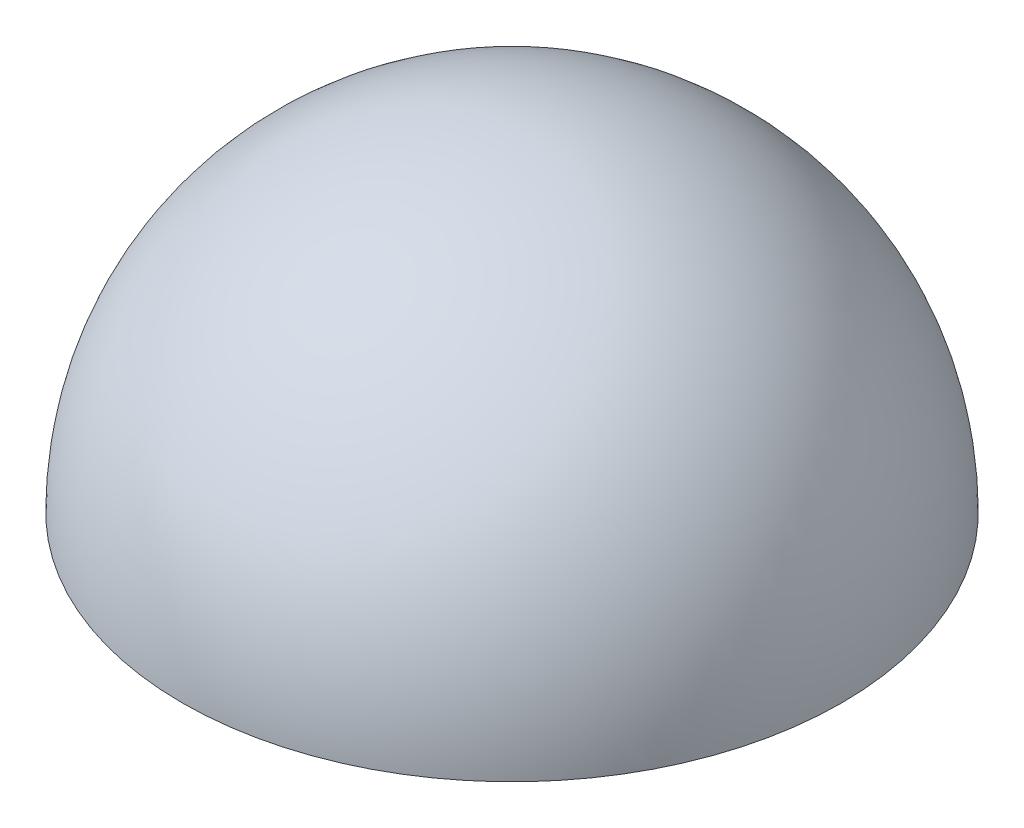
ISO-10303-21;
HEADER;
FILE_DESCRIPTION(('STEP AP214'),'2;1');
FILE_NAME('part.step','',(''),(''),'','','');
FILE_SCHEMA(('AUTOMOTIVE_DESIGN { 1 0 10303 214 1 1 1 1 }'));
ENDSEC;
DATA;
#1=APPLICATION_CONTEXT('core data for automotive mechanical design processes');
#2=APPLICATION_PROTOCOL_DEFINITION('international standard','automotive_design',2000,#1);
#3=PRODUCT_CONTEXT('',#1,'mechanical');
#4=PRODUCT('Part','Part','',(#3));
#5=PRODUCT_RELATED_PRODUCT_CATEGORY('part','',(#4));
#6=PRODUCT_DEFINITION_FORMATION('','',#4);
#7=PRODUCT_DEFINITION_CONTEXT('part definition',#1,'design');
#8=PRODUCT_DEFINITION('design','',#6,#7);
#9=PRODUCT_DEFINITION_SHAPE('','',#8);
#10=(LENGTH_UNIT() NAMED_UNIT(*) SI_UNIT(.MILLI.,.METRE.));
#11=(NAMED_UNIT(*) PLANE_ANGLE_UNIT() SI_UNIT($,.RADIAN.));
#12=(NAMED_UNIT(*) SI_UNIT($,.STERADIAN.) SOLID_ANGLE_UNIT());
#13=UNCERTAINTY_MEASURE_WITH_UNIT(LENGTH_MEASURE(1.E-05),#10,'distance_accuracy_value','');
#14=(GEOMETRIC_REPRESENTATION_CONTEXT(3) GLOBAL_UNCERTAINTY_ASSIGNED_CONTEXT((#13)) GLOBAL_UNIT_ASSIGNED_CONTEXT((#10,
#11,#12)) REPRESENTATION_CONTEXT('',''));
#15=CARTESIAN_POINT('',(0.,0.,0.));
#16=DIRECTION('',(0.,0.,1.));
#17=DIRECTION('',(1.,0.,0.));
#18=AXIS2_PLACEMENT_3D('',#15,#16,#17);
#19=CARTESIAN_POINT('',(0.,0.,0.));
#20=DIRECTION('',(0.,-1.,0.));
#21=DIRECTION('',(-1.,0.,0.));
#22=AXIS2_PLACEMENT_3D('',#19,#20,#21);
#23=SPHERICAL_SURFACE('',#22,12.7);
#24=CARTESIAN_POINT('',(0.,0.,0.));
#25=DIRECTION('',(0.,-1.,0.));
#26=DIRECTION('',(0.,0.,-1.));
#27=AXIS2_PLACEMENT_3D('',#24,#25,#26);
#28=CIRCLE('',#27,12.7);
#29=CARTESIAN_POINT('',(0.,0.,-12.7));
#30=VERTEX_POINT('',#29);
#31=EDGE_CURVE('E10',#30,#30,#28,.T.);
#32=ORIENTED_EDGE('',*,*,#31,.T.);
#33=EDGE_LOOP('',(#32));
#34=FACE_BOUND('',#33,.T.);
#35=ADVANCED_FACE('F35',(#34),#23,.F.);
#36=CARTESIAN_POINT('',(-12.7,0.,0.));
#37=DIRECTION('',(0.,1.,0.));
#38=DIRECTION('',(0.,0.,1.));
#39=AXIS2_PLACEMENT_3D('',#36,#37,#38);
#40=PLANE('',#39);
#41=ORIENTED_EDGE('',*,*,#31,.F.);
#42=EDGE_LOOP('',(#41));
#43=FACE_BOUND('',#42,.T.);
#44=CARTESIAN_POINT('',(0.,0.,0.));
#45=DIRECTION('',(0.,-1.,0.));
#46=DIRECTION('',(0.,0.,-1.));
#47=AXIS2_PLACEMENT_3D('',#44,#45,#46);
#48=CIRCLE('',#47,13.2);
#49=CARTESIAN_POINT('',(0.,0.,-13.2));
#50=VERTEX_POINT('',#49);
#51=EDGE_CURVE('E41',#50,#50,#48,.T.);
#52=ORIENTED_EDGE('',*,*,#51,.T.);
#53=EDGE_LOOP('',(#52));
#54=FACE_BOUND('',#53,.T.);
#55=ADVANCED_FACE('F47',(#43,#54),#40,.F.);
#56=CARTESIAN_POINT('',(0.,0.,0.));
#57=DIRECTION('',(0.,-1.,0.));
#58=DIRECTION('',(-1.,0.,0.));
#59=AXIS2_PLACEMENT_3D('',#56,#57,#58);
#60=SPHERICAL_SURFACE('',#59,13.2);
#61=ORIENTED_EDGE('',*,*,#51,.F.);
#62=EDGE_LOOP('',(#61));
#63=FACE_BOUND('',#62,.T.);
#64=ADVANCED_FACE('F49',(#63),#60,.T.);
#65=CLOSED_SHELL('',(#35,#55,#64));
#66=MANIFOLD_SOLID_BREP('B2',#65);
#67=ADVANCED_BREP_SHAPE_REPRESENTATION('',(#18,#66),#14);
#68=SHAPE_DEFINITION_REPRESENTATION(#9,#67);
ENDSEC;
END-ISO-10303-21;
